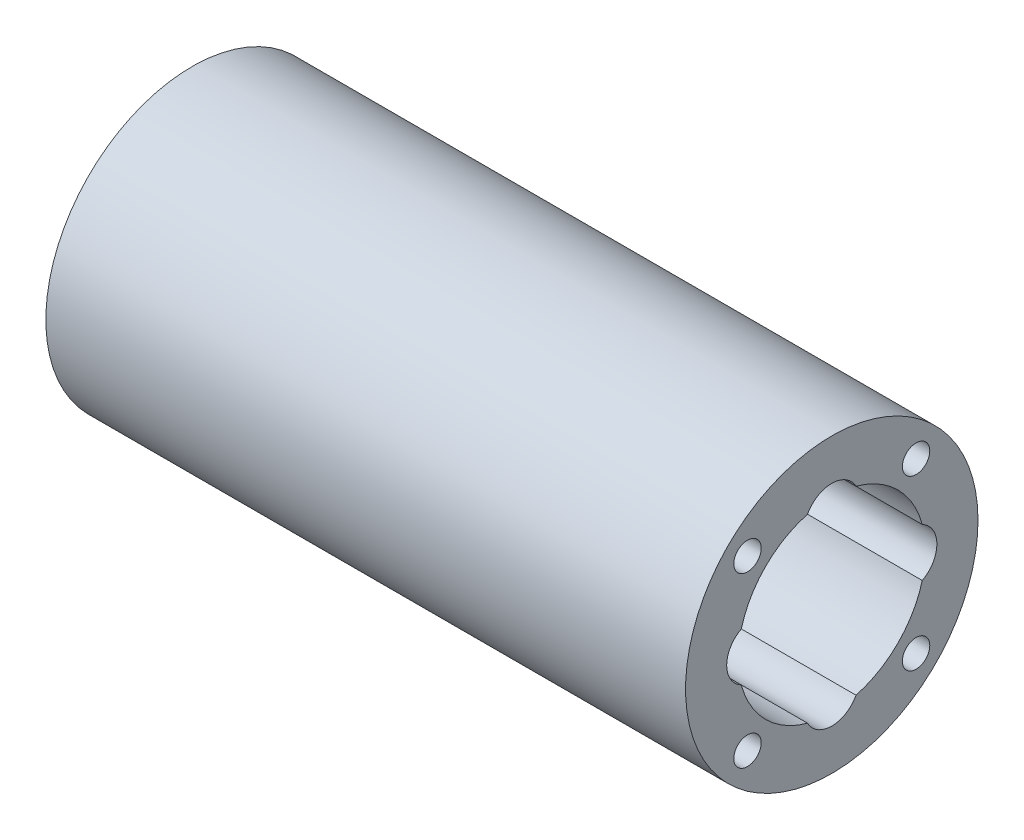
ISO-10303-21;
HEADER;
FILE_DESCRIPTION(('STEP AP214'),'2;1');
FILE_NAME('part.step','',(''),(''),'','','');
FILE_SCHEMA(('AUTOMOTIVE_DESIGN { 1 0 10303 214 1 1 1 1 }'));
ENDSEC;
DATA;
#1=APPLICATION_CONTEXT('core data for automotive mechanical design processes');
#2=APPLICATION_PROTOCOL_DEFINITION('international standard','automotive_design',2000,#1);
#3=PRODUCT_CONTEXT('',#1,'mechanical');
#4=PRODUCT('Part','Part','',(#3));
#5=PRODUCT_RELATED_PRODUCT_CATEGORY('part','',(#4));
#6=PRODUCT_DEFINITION_FORMATION('','',#4);
#7=PRODUCT_DEFINITION_CONTEXT('part definition',#1,'design');
#8=PRODUCT_DEFINITION('design','',#6,#7);
#9=PRODUCT_DEFINITION_SHAPE('','',#8);
#10=(LENGTH_UNIT() NAMED_UNIT(*) SI_UNIT(.MILLI.,.METRE.));
#11=(NAMED_UNIT(*) PLANE_ANGLE_UNIT() SI_UNIT($,.RADIAN.));
#12=(NAMED_UNIT(*) SI_UNIT($,.STERADIAN.) SOLID_ANGLE_UNIT());
#13=UNCERTAINTY_MEASURE_WITH_UNIT(LENGTH_MEASURE(1.E-05),#10,'distance_accuracy_value','');
#14=(GEOMETRIC_REPRESENTATION_CONTEXT(3) GLOBAL_UNCERTAINTY_ASSIGNED_CONTEXT((#13)) GLOBAL_UNIT_ASSIGNED_CONTEXT((#10,
#11,#12)) REPRESENTATION_CONTEXT('',''));
#15=CARTESIAN_POINT('',(0.,0.,0.));
#16=DIRECTION('',(0.,0.,1.));
#17=DIRECTION('',(1.,0.,0.));
#18=AXIS2_PLACEMENT_3D('',#15,#16,#17);
#19=CARTESIAN_POINT('',(3.,0.,0.));
#20=DIRECTION('',(1.,0.,0.));
#21=DIRECTION('',(0.,0.,-1.));
#22=AXIS2_PLACEMENT_3D('',#19,#20,#21);
#23=PLANE('',#22);
#24=CARTESIAN_POINT('',(3.,0.,8.5));
#25=DIRECTION('',(1.,0.,0.));
#26=DIRECTION('',(0.,0.,-1.));
#27=AXIS2_PLACEMENT_3D('',#24,#25,#26);
#28=CIRCLE('',#27,1.5);
#29=CARTESIAN_POINT('',(3.,0.,7.));
#30=VERTEX_POINT('',#29);
#31=EDGE_CURVE('E284',#30,#30,#28,.T.);
#32=ORIENTED_EDGE('',*,*,#31,.F.);
#33=EDGE_LOOP('',(#32));
#34=FACE_BOUND('',#33,.T.);
#35=CARTESIAN_POINT('',(3.,0.,-8.5));
#36=DIRECTION('',(1.,0.,0.));
#37=DIRECTION('',(0.,0.,-1.));
#38=AXIS2_PLACEMENT_3D('',#35,#36,#37);
#39=CIRCLE('',#38,1.5);
#40=CARTESIAN_POINT('',(3.,0.,-10.));
#41=VERTEX_POINT('',#40);
#42=EDGE_CURVE('E295',#41,#41,#39,.T.);
#43=ORIENTED_EDGE('',*,*,#42,.F.);
#44=EDGE_LOOP('',(#43));
#45=FACE_BOUND('',#44,.T.);
#46=CARTESIAN_POINT('',(3.,-8.5,0.));
#47=DIRECTION('',(1.,0.,0.));
#48=DIRECTION('',(0.,0.,-1.));
#49=AXIS2_PLACEMENT_3D('',#46,#47,#48);
#50=CIRCLE('',#49,1.5);
#51=CARTESIAN_POINT('',(3.,-8.5,-1.49999999999994));
#52=VERTEX_POINT('',#51);
#53=EDGE_CURVE('E12',#52,#52,#50,.T.);
#54=ORIENTED_EDGE('',*,*,#53,.F.);
#55=EDGE_LOOP('',(#54));
#56=FACE_BOUND('',#55,.T.);
#57=CARTESIAN_POINT('',(3.,8.5,0.));
#58=DIRECTION('',(1.,0.,0.));
#59=DIRECTION('',(0.,0.,-1.));
#60=AXIS2_PLACEMENT_3D('',#57,#58,#59);
#61=CIRCLE('',#60,1.5);
#62=CARTESIAN_POINT('',(3.,8.5,-1.5));
#63=VERTEX_POINT('',#62);
#64=EDGE_CURVE('E78',#63,#63,#61,.T.);
#65=ORIENTED_EDGE('',*,*,#64,.F.);
#66=EDGE_LOOP('',(#65));
#67=FACE_BOUND('',#66,.T.);
#68=CARTESIAN_POINT('',(3.,0.,0.));
#69=DIRECTION('',(1.,0.,0.));
#70=DIRECTION('',(0.,0.,-1.));
#71=AXIS2_PLACEMENT_3D('',#68,#69,#70);
#72=CIRCLE('',#71,5.25);
#73=CARTESIAN_POINT('',(3.,0.,-5.25));
#74=VERTEX_POINT('',#73);
#75=EDGE_CURVE('E373',#74,#74,#72,.T.);
#76=ORIENTED_EDGE('',*,*,#75,.F.);
#77=EDGE_LOOP('',(#76));
#78=FACE_BOUND('',#77,.T.);
#79=CARTESIAN_POINT('',(3.,-8.5,0.));
#80=DIRECTION('',(1.,0.,0.));
#81=DIRECTION('',(0.,0.,-1.));
#82=AXIS2_PLACEMENT_3D('',#79,#80,#81);
#83=CIRCLE('',#82,3.);
#84=CARTESIAN_POINT('',(3.,-9.90073529411763,2.65291172785932));
#85=VERTEX_POINT('',#84);
#86=CARTESIAN_POINT('',(3.,-9.90073529411767,-2.65291172785918));
#87=VERTEX_POINT('',#86);
#88=EDGE_CURVE('E195',#85,#87,#83,.T.);
#89=ORIENTED_EDGE('',*,*,#88,.T.);
#90=CARTESIAN_POINT('',(3.,0.,0.));
#91=DIRECTION('',(1.,0.,0.));
#92=DIRECTION('',(0.,0.,-1.));
#93=AXIS2_PLACEMENT_3D('',#90,#91,#92);
#94=CIRCLE('',#93,10.25);
#95=CARTESIAN_POINT('',(3.,-2.65291172785928,-9.90073529411764));
#96=VERTEX_POINT('',#95);
#97=EDGE_CURVE('E232',#87,#96,#94,.T.);
#98=ORIENTED_EDGE('',*,*,#97,.T.);
#99=CARTESIAN_POINT('',(3.,0.,-8.5));
#100=DIRECTION('',(1.,0.,0.));
#101=DIRECTION('',(0.,0.,-1.));
#102=AXIS2_PLACEMENT_3D('',#99,#100,#101);
#103=CIRCLE('',#102,3.);
#104=CARTESIAN_POINT('',(3.,2.65291172785921,-9.90073529411766));
#105=VERTEX_POINT('',#104);
#106=EDGE_CURVE('E201',#96,#105,#103,.T.);
#107=ORIENTED_EDGE('',*,*,#106,.T.);
#108=CARTESIAN_POINT('',(3.,0.,0.));
#109=DIRECTION('',(1.,0.,0.));
#110=DIRECTION('',(0.,0.,-1.));
#111=AXIS2_PLACEMENT_3D('',#108,#109,#110);
#112=CIRCLE('',#111,10.25);
#113=CARTESIAN_POINT('',(3.,9.90073529411765,-2.65291172785925));
#114=VERTEX_POINT('',#113);
#115=EDGE_CURVE('E238',#105,#114,#112,.T.);
#116=ORIENTED_EDGE('',*,*,#115,.T.);
#117=CARTESIAN_POINT('',(3.,8.5,0.));
#118=DIRECTION('',(1.,0.,0.));
#119=DIRECTION('',(0.,0.,-1.));
#120=AXIS2_PLACEMENT_3D('',#117,#118,#119);
#121=CIRCLE('',#120,3.);
#122=CARTESIAN_POINT('',(3.,9.90073529411765,2.65291172785925));
#123=VERTEX_POINT('',#122);
#124=EDGE_CURVE('E242',#114,#123,#121,.T.);
#125=ORIENTED_EDGE('',*,*,#124,.T.);
#126=CARTESIAN_POINT('',(3.,0.,0.));
#127=DIRECTION('',(1.,0.,0.));
#128=DIRECTION('',(0.,0.,-1.));
#129=AXIS2_PLACEMENT_3D('',#126,#127,#128);
#130=CIRCLE('',#129,10.25);
#131=CARTESIAN_POINT('',(3.,2.65291172785935,9.90073529411762));
#132=VERTEX_POINT('',#131);
#133=EDGE_CURVE('E246',#123,#132,#130,.T.);
#134=ORIENTED_EDGE('',*,*,#133,.T.);
#135=CARTESIAN_POINT('',(3.,0.,8.5));
#136=DIRECTION('',(1.,0.,0.));
#137=DIRECTION('',(0.,0.,-1.));
#138=AXIS2_PLACEMENT_3D('',#135,#136,#137);
#139=CIRCLE('',#138,3.);
#140=CARTESIAN_POINT('',(3.,-2.65291172785914,9.90073529411768));
#141=VERTEX_POINT('',#140);
#142=EDGE_CURVE('E250',#132,#141,#139,.T.);
#143=ORIENTED_EDGE('',*,*,#142,.T.);
#144=CARTESIAN_POINT('',(3.,0.,0.));
#145=DIRECTION('',(1.,0.,0.));
#146=DIRECTION('',(0.,0.,-1.));
#147=AXIS2_PLACEMENT_3D('',#144,#145,#146);
#148=CIRCLE('',#147,10.25);
#149=EDGE_CURVE('E254',#141,#85,#148,.T.);
#150=ORIENTED_EDGE('',*,*,#149,.T.);
#151=EDGE_LOOP('',(#89,#98,#107,#116,#125,#134,#143,#150));
#152=FACE_BOUND('',#151,.T.);
#153=ADVANCED_FACE('F68',(#34,#45,#56,#67,#78,#152),#23,.T.);
#154=CARTESIAN_POINT('',(3.,0.,8.5));
#155=DIRECTION('',(-1.,0.,0.));
#156=DIRECTION('',(0.,0.,1.));
#157=AXIS2_PLACEMENT_3D('',#154,#155,#156);
#158=CYLINDRICAL_SURFACE('',#157,3.);
#159=DIRECTION('',(1.,0.,0.));
#160=VECTOR('',#159,1.);
#161=CARTESIAN_POINT('',(-10.,2.65291172785935,9.90073529411762));
#162=LINE('',#161,#160);
#163=CARTESIAN_POINT('',(-10.,2.65291172785935,9.90073529411762));
#164=VERTEX_POINT('',#163);
#165=CARTESIAN_POINT('',(0.,2.65291172785935,9.90073529411762));
#166=VERTEX_POINT('',#165);
#167=EDGE_CURVE('E329',#164,#166,#162,.T.);
#168=ORIENTED_EDGE('',*,*,#167,.T.);
#169=CARTESIAN_POINT('',(0.,0.,8.5));
#170=DIRECTION('',(1.,0.,0.));
#171=DIRECTION('',(0.,0.,-1.));
#172=AXIS2_PLACEMENT_3D('',#169,#170,#171);
#173=CIRCLE('',#172,3.);
#174=CARTESIAN_POINT('',(0.,-2.65291172785914,9.90073529411768));
#175=VERTEX_POINT('',#174);
#176=EDGE_CURVE('E289',#166,#175,#173,.T.);
#177=ORIENTED_EDGE('',*,*,#176,.T.);
#178=DIRECTION('',(1.,0.,0.));
#179=VECTOR('',#178,1.);
#180=CARTESIAN_POINT('',(-10.,-2.65291172785914,9.90073529411768));
#181=LINE('',#180,#179);
#182=CARTESIAN_POINT('',(-10.,-2.65291172785914,9.90073529411768));
#183=VERTEX_POINT('',#182);
#184=EDGE_CURVE('E341',#183,#175,#181,.T.);
#185=ORIENTED_EDGE('',*,*,#184,.F.);
#186=CARTESIAN_POINT('',(-10.,0.,8.5));
#187=DIRECTION('',(1.,0.,0.));
#188=DIRECTION('',(0.,0.,-1.));
#189=AXIS2_PLACEMENT_3D('',#186,#187,#188);
#190=CIRCLE('',#189,3.);
#191=EDGE_CURVE('E305',#164,#183,#190,.T.);
#192=ORIENTED_EDGE('',*,*,#191,.F.);
#193=EDGE_LOOP('',(#168,#177,#185,#192));
#194=FACE_BOUND('',#193,.T.);
#195=ADVANCED_FACE('F70',(#194),#158,.F.);
#196=CARTESIAN_POINT('',(3.,0.,-8.5));
#197=DIRECTION('',(-1.,0.,0.));
#198=DIRECTION('',(0.,0.,1.));
#199=AXIS2_PLACEMENT_3D('',#196,#197,#198);
#200=CYLINDRICAL_SURFACE('',#199,3.);
#201=DIRECTION('',(1.,0.,0.));
#202=VECTOR('',#201,1.);
#203=CARTESIAN_POINT('',(-10.,-2.65291172785928,-9.90073529411764));
#204=LINE('',#203,#202);
#205=CARTESIAN_POINT('',(-10.,-2.65291172785928,-9.90073529411764));
#206=VERTEX_POINT('',#205);
#207=CARTESIAN_POINT('',(0.,-2.65291172785928,-9.90073529411764));
#208=VERTEX_POINT('',#207);
#209=EDGE_CURVE('E354',#206,#208,#204,.T.);
#210=ORIENTED_EDGE('',*,*,#209,.T.);
#211=CARTESIAN_POINT('',(0.,0.,-8.5));
#212=DIRECTION('',(1.,0.,0.));
#213=DIRECTION('',(0.,0.,-1.));
#214=AXIS2_PLACEMENT_3D('',#211,#212,#213);
#215=CIRCLE('',#214,3.);
#216=CARTESIAN_POINT('',(0.,2.65291172785921,-9.90073529411766));
#217=VERTEX_POINT('',#216);
#218=EDGE_CURVE('E288',#208,#217,#215,.T.);
#219=ORIENTED_EDGE('',*,*,#218,.T.);
#220=DIRECTION('',(1.,0.,0.));
#221=VECTOR('',#220,1.);
#222=CARTESIAN_POINT('',(-10.,2.65291172785921,-9.90073529411766));
#223=LINE('',#222,#221);
#224=CARTESIAN_POINT('',(-10.,2.65291172785921,-9.90073529411766));
#225=VERTEX_POINT('',#224);
#226=EDGE_CURVE('E358',#225,#217,#223,.T.);
#227=ORIENTED_EDGE('',*,*,#226,.F.);
#228=CARTESIAN_POINT('',(-10.,0.,-8.5));
#229=DIRECTION('',(1.,0.,0.));
#230=DIRECTION('',(0.,0.,-1.));
#231=AXIS2_PLACEMENT_3D('',#228,#229,#230);
#232=CIRCLE('',#231,3.);
#233=EDGE_CURVE('E318',#206,#225,#232,.T.);
#234=ORIENTED_EDGE('',*,*,#233,.F.);
#235=EDGE_LOOP('',(#210,#219,#227,#234));
#236=FACE_BOUND('',#235,.T.);
#237=ADVANCED_FACE('F419',(#236),#200,.F.);
#238=CARTESIAN_POINT('',(0.,0.,0.));
#239=DIRECTION('',(1.,0.,0.));
#240=DIRECTION('',(0.,0.,-1.));
#241=AXIS2_PLACEMENT_3D('',#238,#239,#240);
#242=PLANE('',#241);
#243=CARTESIAN_POINT('',(0.,-8.5,0.));
#244=DIRECTION('',(1.,0.,0.));
#245=DIRECTION('',(0.,0.,-1.));
#246=AXIS2_PLACEMENT_3D('',#243,#244,#245);
#247=CIRCLE('',#246,1.5);
#248=CARTESIAN_POINT('',(0.,-8.5,-1.49999999999994));
#249=VERTEX_POINT('',#248);
#250=EDGE_CURVE('E72',#249,#249,#247,.T.);
#251=ORIENTED_EDGE('',*,*,#250,.T.);
#252=EDGE_LOOP('',(#251));
#253=FACE_BOUND('',#252,.T.);
#254=CARTESIAN_POINT('',(0.,8.5,0.));
#255=DIRECTION('',(1.,0.,0.));
#256=DIRECTION('',(0.,0.,-1.));
#257=AXIS2_PLACEMENT_3D('',#254,#255,#256);
#258=CIRCLE('',#257,1.5);
#259=CARTESIAN_POINT('',(0.,8.5,-1.5));
#260=VERTEX_POINT('',#259);
#261=EDGE_CURVE('E382',#260,#260,#258,.T.);
#262=ORIENTED_EDGE('',*,*,#261,.T.);
#263=EDGE_LOOP('',(#262));
#264=FACE_BOUND('',#263,.T.);
#265=CARTESIAN_POINT('',(0.,0.,0.));
#266=DIRECTION('',(1.,0.,0.));
#267=DIRECTION('',(0.,0.,-1.));
#268=AXIS2_PLACEMENT_3D('',#265,#266,#267);
#269=CIRCLE('',#268,5.25);
#270=CARTESIAN_POINT('',(0.,0.,-5.25));
#271=VERTEX_POINT('',#270);
#272=EDGE_CURVE('E345',#271,#271,#269,.T.);
#273=ORIENTED_EDGE('',*,*,#272,.T.);
#274=EDGE_LOOP('',(#273));
#275=FACE_BOUND('',#274,.T.);
#276=CARTESIAN_POINT('',(0.,0.,0.));
#277=DIRECTION('',(1.,0.,0.));
#278=DIRECTION('',(0.,0.,-1.));
#279=AXIS2_PLACEMENT_3D('',#276,#277,#278);
#280=CIRCLE('',#279,10.25);
#281=CARTESIAN_POINT('',(0.,9.90073529411765,2.65291172785925));
#282=VERTEX_POINT('',#281);
#283=EDGE_CURVE('E94',#282,#166,#280,.T.);
#284=ORIENTED_EDGE('',*,*,#283,.F.);
#285=CARTESIAN_POINT('',(0.,8.5,0.));
#286=DIRECTION('',(1.,0.,0.));
#287=DIRECTION('',(0.,0.,-1.));
#288=AXIS2_PLACEMENT_3D('',#285,#286,#287);
#289=CIRCLE('',#288,3.);
#290=CARTESIAN_POINT('',(0.,9.90073529411765,-2.65291172785925));
#291=VERTEX_POINT('',#290);
#292=EDGE_CURVE('E332',#291,#282,#289,.T.);
#293=ORIENTED_EDGE('',*,*,#292,.F.);
#294=EDGE_CURVE('E333',#217,#291,#280,.T.);
#295=ORIENTED_EDGE('',*,*,#294,.F.);
#296=ORIENTED_EDGE('',*,*,#218,.F.);
#297=CARTESIAN_POINT('',(0.,-9.90073529411767,-2.65291172785918));
#298=VERTEX_POINT('',#297);
#299=EDGE_CURVE('E340',#298,#208,#280,.T.);
#300=ORIENTED_EDGE('',*,*,#299,.F.);
#301=CARTESIAN_POINT('',(0.,-8.5,0.));
#302=DIRECTION('',(1.,0.,0.));
#303=DIRECTION('',(0.,0.,-1.));
#304=AXIS2_PLACEMENT_3D('',#301,#302,#303);
#305=CIRCLE('',#304,3.);
#306=CARTESIAN_POINT('',(0.,-9.90073529411763,2.65291172785932));
#307=VERTEX_POINT('',#306);
#308=EDGE_CURVE('E336',#307,#298,#305,.T.);
#309=ORIENTED_EDGE('',*,*,#308,.F.);
#310=EDGE_CURVE('E310',#175,#307,#280,.T.);
#311=ORIENTED_EDGE('',*,*,#310,.F.);
#312=ORIENTED_EDGE('',*,*,#176,.F.);
#313=EDGE_LOOP('',(#284,#293,#295,#296,#300,#309,#311,#312));
#314=FACE_BOUND('',#313,.T.);
#315=CARTESIAN_POINT('',(0.,0.,-8.5));
#316=DIRECTION('',(1.,0.,0.));
#317=DIRECTION('',(0.,0.,-1.));
#318=AXIS2_PLACEMENT_3D('',#315,#316,#317);
#319=CIRCLE('',#318,1.5);
#320=CARTESIAN_POINT('',(0.,0.,-10.));
#321=VERTEX_POINT('',#320);
#322=EDGE_CURVE('E299',#321,#321,#319,.T.);
#323=ORIENTED_EDGE('',*,*,#322,.T.);
#324=EDGE_LOOP('',(#323));
#325=FACE_BOUND('',#324,.T.);
#326=CARTESIAN_POINT('',(0.,0.,8.5));
#327=DIRECTION('',(1.,0.,0.));
#328=DIRECTION('',(0.,0.,-1.));
#329=AXIS2_PLACEMENT_3D('',#326,#327,#328);
#330=CIRCLE('',#329,1.5);
#331=CARTESIAN_POINT('',(0.,0.,7.));
#332=VERTEX_POINT('',#331);
#333=EDGE_CURVE('E283',#332,#332,#330,.T.);
#334=ORIENTED_EDGE('',*,*,#333,.T.);
#335=EDGE_LOOP('',(#334));
#336=FACE_BOUND('',#335,.T.);
#337=ADVANCED_FACE('F391',(#253,#264,#275,#314,#325,#336),#242,.F.);
#338=CARTESIAN_POINT('',(3.,8.5,0.));
#339=DIRECTION('',(-1.,0.,0.));
#340=DIRECTION('',(0.,0.,1.));
#341=AXIS2_PLACEMENT_3D('',#338,#339,#340);
#342=CYLINDRICAL_SURFACE('',#341,1.5);
#343=ORIENTED_EDGE('',*,*,#64,.T.);
#344=EDGE_LOOP('',(#343));
#345=FACE_BOUND('',#344,.T.);
#346=ORIENTED_EDGE('',*,*,#261,.F.);
#347=EDGE_LOOP('',(#346));
#348=FACE_BOUND('',#347,.T.);
#349=ADVANCED_FACE('F427',(#345,#348),#342,.F.);
#350=CARTESIAN_POINT('',(3.,0.,0.));
#351=DIRECTION('',(-1.,0.,0.));
#352=DIRECTION('',(0.,0.,1.));
#353=AXIS2_PLACEMENT_3D('',#350,#351,#352);
#354=CYLINDRICAL_SURFACE('',#353,5.25);
#355=ORIENTED_EDGE('',*,*,#75,.T.);
#356=EDGE_LOOP('',(#355));
#357=FACE_BOUND('',#356,.T.);
#358=ORIENTED_EDGE('',*,*,#272,.F.);
#359=EDGE_LOOP('',(#358));
#360=FACE_BOUND('',#359,.T.);
#361=ADVANCED_FACE('F408',(#357,#360),#354,.F.);
#362=CARTESIAN_POINT('',(3.,0.,0.));
#363=DIRECTION('',(-1.,0.,0.));
#364=DIRECTION('',(0.,0.,1.));
#365=AXIS2_PLACEMENT_3D('',#362,#363,#364);
#366=CYLINDRICAL_SURFACE('',#365,16.);
#367=CARTESIAN_POINT('',(-10.,0.,0.));
#368=DIRECTION('',(1.,0.,0.));
#369=DIRECTION('',(0.,0.,-1.));
#370=AXIS2_PLACEMENT_3D('',#367,#368,#369);
#371=CIRCLE('',#370,16.);
#372=CARTESIAN_POINT('',(-10.,0.,-16.));
#373=VERTEX_POINT('',#372);
#374=EDGE_CURVE('E325',#373,#373,#371,.T.);
#375=ORIENTED_EDGE('',*,*,#374,.T.);
#376=EDGE_LOOP('',(#375));
#377=FACE_BOUND('',#376,.T.);
#378=CARTESIAN_POINT('',(60.,0.,0.));
#379=DIRECTION('',(1.,0.,0.));
#380=DIRECTION('',(0.,0.,-1.));
#381=AXIS2_PLACEMENT_3D('',#378,#379,#380);
#382=CIRCLE('',#381,16.);
#383=CARTESIAN_POINT('',(60.,0.,-16.));
#384=VERTEX_POINT('',#383);
#385=EDGE_CURVE('E203',#384,#384,#382,.T.);
#386=ORIENTED_EDGE('',*,*,#385,.F.);
#387=EDGE_LOOP('',(#386));
#388=FACE_BOUND('',#387,.T.);
#389=ADVANCED_FACE('F396',(#377,#388),#366,.T.);
#390=CARTESIAN_POINT('',(3.,-8.5,0.));
#391=DIRECTION('',(-1.,0.,0.));
#392=DIRECTION('',(0.,0.,1.));
#393=AXIS2_PLACEMENT_3D('',#390,#391,#392);
#394=CYLINDRICAL_SURFACE('',#393,1.5);
#395=ORIENTED_EDGE('',*,*,#53,.T.);
#396=EDGE_LOOP('',(#395));
#397=FACE_BOUND('',#396,.T.);
#398=ORIENTED_EDGE('',*,*,#250,.F.);
#399=EDGE_LOOP('',(#398));
#400=FACE_BOUND('',#399,.T.);
#401=ADVANCED_FACE('F393',(#397,#400),#394,.F.);
#402=CARTESIAN_POINT('',(-10.,0.,0.));
#403=DIRECTION('',(1.,0.,0.));
#404=DIRECTION('',(0.,0.,-1.));
#405=AXIS2_PLACEMENT_3D('',#402,#403,#404);
#406=CYLINDRICAL_SURFACE('',#405,10.25);
#407=ORIENTED_EDGE('',*,*,#310,.T.);
#408=DIRECTION('',(1.,0.,0.));
#409=VECTOR('',#408,1.);
#410=CARTESIAN_POINT('',(-10.,-9.90073529411763,2.65291172785932));
#411=LINE('',#410,#409);
#412=CARTESIAN_POINT('',(-10.,-9.90073529411763,2.65291172785932));
#413=VERTEX_POINT('',#412);
#414=EDGE_CURVE('E346',#413,#307,#411,.T.);
#415=ORIENTED_EDGE('',*,*,#414,.F.);
#416=CARTESIAN_POINT('',(-10.,0.,0.));
#417=DIRECTION('',(1.,0.,0.));
#418=DIRECTION('',(0.,0.,-1.));
#419=AXIS2_PLACEMENT_3D('',#416,#417,#418);
#420=CIRCLE('',#419,10.25);
#421=EDGE_CURVE('E314',#183,#413,#420,.T.);
#422=ORIENTED_EDGE('',*,*,#421,.F.);
#423=ORIENTED_EDGE('',*,*,#184,.T.);
#424=EDGE_LOOP('',(#407,#415,#422,#423));
#425=FACE_BOUND('',#424,.T.);
#426=ADVANCED_FACE('F395',(#425),#406,.F.);
#427=CARTESIAN_POINT('',(-10.,-8.5,0.));
#428=DIRECTION('',(1.,0.,0.));
#429=DIRECTION('',(0.,0.,-1.));
#430=AXIS2_PLACEMENT_3D('',#427,#428,#429);
#431=CYLINDRICAL_SURFACE('',#430,3.);
#432=ORIENTED_EDGE('',*,*,#308,.T.);
#433=DIRECTION('',(1.,0.,0.));
#434=VECTOR('',#433,1.);
#435=CARTESIAN_POINT('',(-10.,-9.90073529411767,-2.65291172785918));
#436=LINE('',#435,#434);
#437=CARTESIAN_POINT('',(-10.,-9.90073529411767,-2.65291172785918));
#438=VERTEX_POINT('',#437);
#439=EDGE_CURVE('E350',#438,#298,#436,.T.);
#440=ORIENTED_EDGE('',*,*,#439,.F.);
#441=CARTESIAN_POINT('',(-10.,-8.5,0.));
#442=DIRECTION('',(1.,0.,0.));
#443=DIRECTION('',(0.,0.,-1.));
#444=AXIS2_PLACEMENT_3D('',#441,#442,#443);
#445=CIRCLE('',#444,3.);
#446=EDGE_CURVE('E322',#413,#438,#445,.T.);
#447=ORIENTED_EDGE('',*,*,#446,.F.);
#448=ORIENTED_EDGE('',*,*,#414,.T.);
#449=EDGE_LOOP('',(#432,#440,#447,#448));
#450=FACE_BOUND('',#449,.T.);
#451=ADVANCED_FACE('F403',(#450),#431,.F.);
#452=ORIENTED_EDGE('',*,*,#299,.T.);
#453=ORIENTED_EDGE('',*,*,#209,.F.);
#454=EDGE_CURVE('E321',#438,#206,#420,.T.);
#455=ORIENTED_EDGE('',*,*,#454,.F.);
#456=ORIENTED_EDGE('',*,*,#439,.T.);
#457=EDGE_LOOP('',(#452,#453,#455,#456));
#458=FACE_BOUND('',#457,.T.);
#459=ADVANCED_FACE('F407',(#458),#406,.F.);
#460=ORIENTED_EDGE('',*,*,#294,.T.);
#461=DIRECTION('',(1.,0.,0.));
#462=VECTOR('',#461,1.);
#463=CARTESIAN_POINT('',(-10.,9.90073529411765,-2.65291172785925));
#464=LINE('',#463,#462);
#465=CARTESIAN_POINT('',(-10.,9.90073529411765,-2.65291172785925));
#466=VERTEX_POINT('',#465);
#467=EDGE_CURVE('E362',#466,#291,#464,.T.);
#468=ORIENTED_EDGE('',*,*,#467,.F.);
#469=EDGE_CURVE('E315',#225,#466,#420,.T.);
#470=ORIENTED_EDGE('',*,*,#469,.F.);
#471=ORIENTED_EDGE('',*,*,#226,.T.);
#472=EDGE_LOOP('',(#460,#468,#470,#471));
#473=FACE_BOUND('',#472,.T.);
#474=ADVANCED_FACE('F473',(#473),#406,.F.);
#475=CARTESIAN_POINT('',(-10.,8.5,0.));
#476=DIRECTION('',(1.,0.,0.));
#477=DIRECTION('',(0.,0.,-1.));
#478=AXIS2_PLACEMENT_3D('',#475,#476,#477);
#479=CYLINDRICAL_SURFACE('',#478,3.);
#480=ORIENTED_EDGE('',*,*,#292,.T.);
#481=DIRECTION('',(1.,0.,0.));
#482=VECTOR('',#481,1.);
#483=CARTESIAN_POINT('',(-10.,9.90073529411765,2.65291172785925));
#484=LINE('',#483,#482);
#485=CARTESIAN_POINT('',(-10.,9.90073529411765,2.65291172785925));
#486=VERTEX_POINT('',#485);
#487=EDGE_CURVE('E366',#486,#282,#484,.T.);
#488=ORIENTED_EDGE('',*,*,#487,.F.);
#489=CARTESIAN_POINT('',(-10.,8.5,0.));
#490=DIRECTION('',(1.,0.,0.));
#491=DIRECTION('',(0.,0.,-1.));
#492=AXIS2_PLACEMENT_3D('',#489,#490,#491);
#493=CIRCLE('',#492,3.);
#494=EDGE_CURVE('E313',#466,#486,#493,.T.);
#495=ORIENTED_EDGE('',*,*,#494,.F.);
#496=ORIENTED_EDGE('',*,*,#467,.T.);
#497=EDGE_LOOP('',(#480,#488,#495,#496));
#498=FACE_BOUND('',#497,.T.);
#499=ADVANCED_FACE('F424',(#498),#479,.F.);
#500=ORIENTED_EDGE('',*,*,#283,.T.);
#501=ORIENTED_EDGE('',*,*,#167,.F.);
#502=EDGE_CURVE('E309',#486,#164,#420,.T.);
#503=ORIENTED_EDGE('',*,*,#502,.F.);
#504=ORIENTED_EDGE('',*,*,#487,.T.);
#505=EDGE_LOOP('',(#500,#501,#503,#504));
#506=FACE_BOUND('',#505,.T.);
#507=ADVANCED_FACE('F406',(#506),#406,.F.);
#508=CARTESIAN_POINT('',(-10.,0.,0.));
#509=DIRECTION('',(1.,0.,0.));
#510=DIRECTION('',(0.,0.,-1.));
#511=AXIS2_PLACEMENT_3D('',#508,#509,#510);
#512=PLANE('',#511);
#513=ORIENTED_EDGE('',*,*,#191,.T.);
#514=ORIENTED_EDGE('',*,*,#421,.T.);
#515=ORIENTED_EDGE('',*,*,#446,.T.);
#516=ORIENTED_EDGE('',*,*,#454,.T.);
#517=ORIENTED_EDGE('',*,*,#233,.T.);
#518=ORIENTED_EDGE('',*,*,#469,.T.);
#519=ORIENTED_EDGE('',*,*,#494,.T.);
#520=ORIENTED_EDGE('',*,*,#502,.T.);
#521=EDGE_LOOP('',(#513,#514,#515,#516,#517,#518,#519,#520));
#522=FACE_BOUND('',#521,.T.);
#523=ORIENTED_EDGE('',*,*,#374,.F.);
#524=EDGE_LOOP('',(#523));
#525=FACE_BOUND('',#524,.T.);
#526=ADVANCED_FACE('F461',(#522,#525),#512,.F.);
#527=CARTESIAN_POINT('',(3.,0.,-8.5));
#528=DIRECTION('',(-1.,0.,0.));
#529=DIRECTION('',(0.,0.,1.));
#530=AXIS2_PLACEMENT_3D('',#527,#528,#529);
#531=CYLINDRICAL_SURFACE('',#530,1.5);
#532=ORIENTED_EDGE('',*,*,#42,.T.);
#533=EDGE_LOOP('',(#532));
#534=FACE_BOUND('',#533,.T.);
#535=ORIENTED_EDGE('',*,*,#322,.F.);
#536=EDGE_LOOP('',(#535));
#537=FACE_BOUND('',#536,.T.);
#538=ADVANCED_FACE('F452',(#534,#537),#531,.F.);
#539=CARTESIAN_POINT('',(3.,0.,8.5));
#540=DIRECTION('',(-1.,0.,0.));
#541=DIRECTION('',(0.,0.,1.));
#542=AXIS2_PLACEMENT_3D('',#539,#540,#541);
#543=CYLINDRICAL_SURFACE('',#542,1.5);
#544=ORIENTED_EDGE('',*,*,#31,.T.);
#545=EDGE_LOOP('',(#544));
#546=FACE_BOUND('',#545,.T.);
#547=ORIENTED_EDGE('',*,*,#333,.F.);
#548=EDGE_LOOP('',(#547));
#549=FACE_BOUND('',#548,.T.);
#550=ADVANCED_FACE('F450',(#546,#549),#543,.F.);
#551=CARTESIAN_POINT('',(60.,0.,0.));
#552=DIRECTION('',(1.,0.,0.));
#553=DIRECTION('',(0.,0.,-1.));
#554=AXIS2_PLACEMENT_3D('',#551,#552,#553);
#555=PLANE('',#554);
#556=CARTESIAN_POINT('',(60.,-9.22279874055178,9.22279874055283));
#557=DIRECTION('',(1.,0.,0.));
#558=DIRECTION('',(0.,0.,-1.));
#559=AXIS2_PLACEMENT_3D('',#556,#557,#558);
#560=CIRCLE('',#559,1.50000000000067);
#561=CARTESIAN_POINT('',(60.,-9.22279874055178,7.72279874055215));
#562=VERTEX_POINT('',#561);
#563=EDGE_CURVE('E783',#562,#562,#560,.T.);
#564=ORIENTED_EDGE('',*,*,#563,.F.);
#565=EDGE_LOOP('',(#564));
#566=FACE_BOUND('',#565,.T.);
#567=CARTESIAN_POINT('',(60.,-9.2227987405523,-9.22279874055178));
#568=DIRECTION('',(1.,0.,0.));
#569=DIRECTION('',(0.,0.,-1.));
#570=AXIS2_PLACEMENT_3D('',#567,#568,#569);
#571=CIRCLE('',#570,1.50000000000021);
#572=CARTESIAN_POINT('',(60.,-9.2227987405523,-10.722798740552));
#573=VERTEX_POINT('',#572);
#574=EDGE_CURVE('E782',#573,#573,#571,.T.);
#575=ORIENTED_EDGE('',*,*,#574,.F.);
#576=EDGE_LOOP('',(#575));
#577=FACE_BOUND('',#576,.T.);
#578=CARTESIAN_POINT('',(60.,9.22279874055226,-9.22279874055235));
#579=DIRECTION('',(1.,0.,0.));
#580=DIRECTION('',(0.,0.,-1.));
#581=AXIS2_PLACEMENT_3D('',#578,#579,#580);
#582=CIRCLE('',#581,1.5);
#583=CARTESIAN_POINT('',(60.,9.22279874055226,-10.7227987405524));
#584=VERTEX_POINT('',#583);
#585=EDGE_CURVE('E804',#584,#584,#582,.T.);
#586=ORIENTED_EDGE('',*,*,#585,.F.);
#587=EDGE_LOOP('',(#586));
#588=FACE_BOUND('',#587,.T.);
#589=CARTESIAN_POINT('',(60.,9.22279874055283,9.2227987405523));
#590=DIRECTION('',(1.,0.,0.));
#591=DIRECTION('',(0.,0.,-1.));
#592=AXIS2_PLACEMENT_3D('',#589,#590,#591);
#593=CIRCLE('',#592,1.50000000000048);
#594=CARTESIAN_POINT('',(60.,9.22279874055283,7.72279874055182));
#595=VERTEX_POINT('',#594);
#596=EDGE_CURVE('E796',#595,#595,#593,.T.);
#597=ORIENTED_EDGE('',*,*,#596,.F.);
#598=EDGE_LOOP('',(#597));
#599=FACE_BOUND('',#598,.T.);
#600=ORIENTED_EDGE('',*,*,#385,.T.);
#601=EDGE_LOOP('',(#600));
#602=FACE_BOUND('',#601,.T.);
#603=CARTESIAN_POINT('',(60.,0.,-8.5));
#604=DIRECTION('',(1.,0.,0.));
#605=DIRECTION('',(0.,0.,-1.));
#606=AXIS2_PLACEMENT_3D('',#603,#604,#605);
#607=CIRCLE('',#606,3.);
#608=CARTESIAN_POINT('',(60.,-2.65291172785928,-9.90073529411764));
#609=VERTEX_POINT('',#608);
#610=CARTESIAN_POINT('',(60.,2.65291172785921,-9.90073529411766));
#611=VERTEX_POINT('',#610);
#612=EDGE_CURVE('E194',#609,#611,#607,.T.);
#613=ORIENTED_EDGE('',*,*,#612,.F.);
#614=CARTESIAN_POINT('',(60.,0.,0.));
#615=DIRECTION('',(1.,0.,0.));
#616=DIRECTION('',(0.,0.,-1.));
#617=AXIS2_PLACEMENT_3D('',#614,#615,#616);
#618=CIRCLE('',#617,10.25);
#619=CARTESIAN_POINT('',(60.,-9.90073529411767,-2.65291172785918));
#620=VERTEX_POINT('',#619);
#621=EDGE_CURVE('E185',#620,#609,#618,.T.);
#622=ORIENTED_EDGE('',*,*,#621,.F.);
#623=CARTESIAN_POINT('',(60.,-8.5,0.));
#624=DIRECTION('',(1.,0.,0.));
#625=DIRECTION('',(0.,0.,-1.));
#626=AXIS2_PLACEMENT_3D('',#623,#624,#625);
#627=CIRCLE('',#626,3.);
#628=CARTESIAN_POINT('',(60.,-9.90073529411763,2.65291172785932));
#629=VERTEX_POINT('',#628);
#630=EDGE_CURVE('E229',#629,#620,#627,.T.);
#631=ORIENTED_EDGE('',*,*,#630,.F.);
#632=CARTESIAN_POINT('',(60.,0.,0.));
#633=DIRECTION('',(1.,0.,0.));
#634=DIRECTION('',(0.,0.,-1.));
#635=AXIS2_PLACEMENT_3D('',#632,#633,#634);
#636=CIRCLE('',#635,10.25);
#637=CARTESIAN_POINT('',(60.,-2.65291172785914,9.90073529411768));
#638=VERTEX_POINT('',#637);
#639=EDGE_CURVE('E225',#638,#629,#636,.T.);
#640=ORIENTED_EDGE('',*,*,#639,.F.);
#641=CARTESIAN_POINT('',(60.,0.,8.5));
#642=DIRECTION('',(1.,0.,0.));
#643=DIRECTION('',(0.,0.,-1.));
#644=AXIS2_PLACEMENT_3D('',#641,#642,#643);
#645=CIRCLE('',#644,3.);
#646=CARTESIAN_POINT('',(60.,2.65291172785935,9.90073529411762));
#647=VERTEX_POINT('',#646);
#648=EDGE_CURVE('E222',#647,#638,#645,.T.);
#649=ORIENTED_EDGE('',*,*,#648,.F.);
#650=CARTESIAN_POINT('',(60.,0.,0.));
#651=DIRECTION('',(1.,0.,0.));
#652=DIRECTION('',(0.,0.,-1.));
#653=AXIS2_PLACEMENT_3D('',#650,#651,#652);
#654=CIRCLE('',#653,10.25);
#655=CARTESIAN_POINT('',(60.,9.90073529411765,2.65291172785925));
#656=VERTEX_POINT('',#655);
#657=EDGE_CURVE('E219',#656,#647,#654,.T.);
#658=ORIENTED_EDGE('',*,*,#657,.F.);
#659=CARTESIAN_POINT('',(60.,8.5,0.));
#660=DIRECTION('',(1.,0.,0.));
#661=DIRECTION('',(0.,0.,-1.));
#662=AXIS2_PLACEMENT_3D('',#659,#660,#661);
#663=CIRCLE('',#662,3.);
#664=CARTESIAN_POINT('',(60.,9.90073529411765,-2.65291172785925));
#665=VERTEX_POINT('',#664);
#666=EDGE_CURVE('E213',#665,#656,#663,.T.);
#667=ORIENTED_EDGE('',*,*,#666,.F.);
#668=CARTESIAN_POINT('',(60.,0.,0.));
#669=DIRECTION('',(1.,0.,0.));
#670=DIRECTION('',(0.,0.,-1.));
#671=AXIS2_PLACEMENT_3D('',#668,#669,#670);
#672=CIRCLE('',#671,10.25);
#673=EDGE_CURVE('E209',#611,#665,#672,.T.);
#674=ORIENTED_EDGE('',*,*,#673,.F.);
#675=EDGE_LOOP('',(#613,#622,#631,#640,#649,#658,#667,#674));
#676=FACE_BOUND('',#675,.T.);
#677=ADVANCED_FACE('F207',(#566,#577,#588,#599,#602,#676),#555,.T.);
#678=CARTESIAN_POINT('',(60.,0.,0.));
#679=DIRECTION('',(-1.,0.,0.));
#680=DIRECTION('',(0.,0.,1.));
#681=AXIS2_PLACEMENT_3D('',#678,#679,#680);
#682=CYLINDRICAL_SURFACE('',#681,10.25);
#683=ORIENTED_EDGE('',*,*,#97,.F.);
#684=DIRECTION('',(-1.,0.,0.));
#685=VECTOR('',#684,1.);
#686=CARTESIAN_POINT('',(60.,-9.90073529411767,-2.65291172785918));
#687=LINE('',#686,#685);
#688=EDGE_CURVE('E86',#620,#87,#687,.T.);
#689=ORIENTED_EDGE('',*,*,#688,.F.);
#690=ORIENTED_EDGE('',*,*,#621,.T.);
#691=DIRECTION('',(-1.,0.,0.));
#692=VECTOR('',#691,1.);
#693=CARTESIAN_POINT('',(60.,-2.65291172785928,-9.90073529411764));
#694=LINE('',#693,#692);
#695=EDGE_CURVE('E188',#609,#96,#694,.T.);
#696=ORIENTED_EDGE('',*,*,#695,.T.);
#697=EDGE_LOOP('',(#683,#689,#690,#696));
#698=FACE_BOUND('',#697,.T.);
#699=ADVANCED_FACE('F187',(#698),#682,.F.);
#700=CARTESIAN_POINT('',(60.,0.,-8.5));
#701=DIRECTION('',(-1.,0.,0.));
#702=DIRECTION('',(0.,0.,1.));
#703=AXIS2_PLACEMENT_3D('',#700,#701,#702);
#704=CYLINDRICAL_SURFACE('',#703,3.);
#705=ORIENTED_EDGE('',*,*,#106,.F.);
#706=ORIENTED_EDGE('',*,*,#695,.F.);
#707=ORIENTED_EDGE('',*,*,#612,.T.);
#708=DIRECTION('',(-1.,0.,0.));
#709=VECTOR('',#708,1.);
#710=CARTESIAN_POINT('',(60.,2.65291172785921,-9.90073529411766));
#711=LINE('',#710,#709);
#712=EDGE_CURVE('E204',#611,#105,#711,.T.);
#713=ORIENTED_EDGE('',*,*,#712,.T.);
#714=EDGE_LOOP('',(#705,#706,#707,#713));
#715=FACE_BOUND('',#714,.T.);
#716=ADVANCED_FACE('F198',(#715),#704,.F.);
#717=CARTESIAN_POINT('',(60.,0.,0.));
#718=DIRECTION('',(-1.,0.,0.));
#719=DIRECTION('',(0.,0.,1.));
#720=AXIS2_PLACEMENT_3D('',#717,#718,#719);
#721=CYLINDRICAL_SURFACE('',#720,10.25);
#722=ORIENTED_EDGE('',*,*,#115,.F.);
#723=ORIENTED_EDGE('',*,*,#712,.F.);
#724=ORIENTED_EDGE('',*,*,#673,.T.);
#725=DIRECTION('',(-1.,0.,0.));
#726=VECTOR('',#725,1.);
#727=CARTESIAN_POINT('',(60.,9.90073529411765,-2.65291172785925));
#728=LINE('',#727,#726);
#729=EDGE_CURVE('E275',#665,#114,#728,.T.);
#730=ORIENTED_EDGE('',*,*,#729,.T.);
#731=EDGE_LOOP('',(#722,#723,#724,#730));
#732=FACE_BOUND('',#731,.T.);
#733=ADVANCED_FACE('F637',(#732),#721,.F.);
#734=CARTESIAN_POINT('',(60.,8.5,0.));
#735=DIRECTION('',(-1.,0.,0.));
#736=DIRECTION('',(0.,0.,1.));
#737=AXIS2_PLACEMENT_3D('',#734,#735,#736);
#738=CYLINDRICAL_SURFACE('',#737,3.);
#739=ORIENTED_EDGE('',*,*,#124,.F.);
#740=ORIENTED_EDGE('',*,*,#729,.F.);
#741=ORIENTED_EDGE('',*,*,#666,.T.);
#742=DIRECTION('',(-1.,0.,0.));
#743=VECTOR('',#742,1.);
#744=CARTESIAN_POINT('',(60.,9.90073529411765,2.65291172785925));
#745=LINE('',#744,#743);
#746=EDGE_CURVE('E272',#656,#123,#745,.T.);
#747=ORIENTED_EDGE('',*,*,#746,.T.);
#748=EDGE_LOOP('',(#739,#740,#741,#747));
#749=FACE_BOUND('',#748,.T.);
#750=ADVANCED_FACE('F645',(#749),#738,.F.);
#751=CARTESIAN_POINT('',(60.,0.,0.));
#752=DIRECTION('',(-1.,0.,0.));
#753=DIRECTION('',(0.,0.,1.));
#754=AXIS2_PLACEMENT_3D('',#751,#752,#753);
#755=CYLINDRICAL_SURFACE('',#754,10.25);
#756=ORIENTED_EDGE('',*,*,#133,.F.);
#757=ORIENTED_EDGE('',*,*,#746,.F.);
#758=ORIENTED_EDGE('',*,*,#657,.T.);
#759=DIRECTION('',(-1.,0.,0.));
#760=VECTOR('',#759,1.);
#761=CARTESIAN_POINT('',(60.,2.65291172785935,9.90073529411762));
#762=LINE('',#761,#760);
#763=EDGE_CURVE('E269',#647,#132,#762,.T.);
#764=ORIENTED_EDGE('',*,*,#763,.T.);
#765=EDGE_LOOP('',(#756,#757,#758,#764));
#766=FACE_BOUND('',#765,.T.);
#767=ADVANCED_FACE('F654',(#766),#755,.F.);
#768=CARTESIAN_POINT('',(60.,0.,8.5));
#769=DIRECTION('',(-1.,0.,0.));
#770=DIRECTION('',(0.,0.,1.));
#771=AXIS2_PLACEMENT_3D('',#768,#769,#770);
#772=CYLINDRICAL_SURFACE('',#771,3.);
#773=ORIENTED_EDGE('',*,*,#142,.F.);
#774=ORIENTED_EDGE('',*,*,#763,.F.);
#775=ORIENTED_EDGE('',*,*,#648,.T.);
#776=DIRECTION('',(-1.,0.,0.));
#777=VECTOR('',#776,1.);
#778=CARTESIAN_POINT('',(60.,-2.65291172785914,9.90073529411768));
#779=LINE('',#778,#777);
#780=EDGE_CURVE('E266',#638,#141,#779,.T.);
#781=ORIENTED_EDGE('',*,*,#780,.T.);
#782=EDGE_LOOP('',(#773,#774,#775,#781));
#783=FACE_BOUND('',#782,.T.);
#784=ADVANCED_FACE('F663',(#783),#772,.F.);
#785=CARTESIAN_POINT('',(60.,0.,0.));
#786=DIRECTION('',(-1.,0.,0.));
#787=DIRECTION('',(0.,0.,1.));
#788=AXIS2_PLACEMENT_3D('',#785,#786,#787);
#789=CYLINDRICAL_SURFACE('',#788,10.25);
#790=ORIENTED_EDGE('',*,*,#149,.F.);
#791=ORIENTED_EDGE('',*,*,#780,.F.);
#792=ORIENTED_EDGE('',*,*,#639,.T.);
#793=DIRECTION('',(-1.,0.,0.));
#794=VECTOR('',#793,1.);
#795=CARTESIAN_POINT('',(60.,-9.90073529411763,2.65291172785932));
#796=LINE('',#795,#794);
#797=EDGE_CURVE('E263',#629,#85,#796,.T.);
#798=ORIENTED_EDGE('',*,*,#797,.T.);
#799=EDGE_LOOP('',(#790,#791,#792,#798));
#800=FACE_BOUND('',#799,.T.);
#801=ADVANCED_FACE('F672',(#800),#789,.F.);
#802=CARTESIAN_POINT('',(60.,-8.5,0.));
#803=DIRECTION('',(-1.,0.,0.));
#804=DIRECTION('',(0.,0.,1.));
#805=AXIS2_PLACEMENT_3D('',#802,#803,#804);
#806=CYLINDRICAL_SURFACE('',#805,3.);
#807=ORIENTED_EDGE('',*,*,#88,.F.);
#808=ORIENTED_EDGE('',*,*,#797,.F.);
#809=ORIENTED_EDGE('',*,*,#630,.T.);
#810=ORIENTED_EDGE('',*,*,#688,.T.);
#811=EDGE_LOOP('',(#807,#808,#809,#810));
#812=FACE_BOUND('',#811,.T.);
#813=ADVANCED_FACE('F681',(#812),#806,.F.);
#814=CARTESIAN_POINT('',(55.,9.22279874055283,9.2227987405523));
#815=DIRECTION('',(1.,0.,0.));
#816=DIRECTION('',(0.,0.,-1.));
#817=AXIS2_PLACEMENT_3D('',#814,#815,#816);
#818=CYLINDRICAL_SURFACE('',#817,1.50000000000048);
#819=CARTESIAN_POINT('',(55.,9.22279874055283,9.2227987405523));
#820=DIRECTION('',(1.,0.,0.));
#821=DIRECTION('',(0.,0.,-1.));
#822=AXIS2_PLACEMENT_3D('',#819,#820,#821);
#823=CIRCLE('',#822,1.50000000000048);
#824=CARTESIAN_POINT('',(55.,9.22279874055283,7.72279874055182));
#825=VERTEX_POINT('',#824);
#826=EDGE_CURVE('E235',#825,#825,#823,.T.);
#827=ORIENTED_EDGE('',*,*,#826,.F.);
#828=EDGE_LOOP('',(#827));
#829=FACE_BOUND('',#828,.T.);
#830=ORIENTED_EDGE('',*,*,#596,.T.);
#831=EDGE_LOOP('',(#830));
#832=FACE_BOUND('',#831,.T.);
#833=ADVANCED_FACE('F689',(#829,#832),#818,.F.);
#834=CARTESIAN_POINT('',(55.,9.22279874055283,9.2227987405523));
#835=DIRECTION('',(1.,0.,0.));
#836=DIRECTION('',(0.,0.,-1.));
#837=AXIS2_PLACEMENT_3D('',#834,#835,#836);
#838=PLANE('',#837);
#839=ORIENTED_EDGE('',*,*,#826,.T.);
#840=EDGE_LOOP('',(#839));
#841=FACE_BOUND('',#840,.T.);
#842=ADVANCED_FACE('F696',(#841),#838,.T.);
#843=CARTESIAN_POINT('',(55.,9.22279874055226,-9.22279874055235));
#844=DIRECTION('',(1.,0.,0.));
#845=DIRECTION('',(0.,0.,-1.));
#846=AXIS2_PLACEMENT_3D('',#843,#844,#845);
#847=CYLINDRICAL_SURFACE('',#846,1.5);
#848=CARTESIAN_POINT('',(55.,9.22279874055226,-9.22279874055235));
#849=DIRECTION('',(1.,0.,0.));
#850=DIRECTION('',(0.,0.,-1.));
#851=AXIS2_PLACEMENT_3D('',#848,#849,#850);
#852=CIRCLE('',#851,1.5);
#853=CARTESIAN_POINT('',(55.,9.22279874055226,-10.7227987405524));
#854=VERTEX_POINT('',#853);
#855=EDGE_CURVE('E799',#854,#854,#852,.T.);
#856=ORIENTED_EDGE('',*,*,#855,.F.);
#857=EDGE_LOOP('',(#856));
#858=FACE_BOUND('',#857,.T.);
#859=ORIENTED_EDGE('',*,*,#585,.T.);
#860=EDGE_LOOP('',(#859));
#861=FACE_BOUND('',#860,.T.);
#862=ADVANCED_FACE('F705',(#858,#861),#847,.F.);
#863=CARTESIAN_POINT('',(55.,9.22279874055226,-9.22279874055235));
#864=DIRECTION('',(1.,0.,0.));
#865=DIRECTION('',(0.,0.,-1.));
#866=AXIS2_PLACEMENT_3D('',#863,#864,#865);
#867=PLANE('',#866);
#868=ORIENTED_EDGE('',*,*,#855,.T.);
#869=EDGE_LOOP('',(#868));
#870=FACE_BOUND('',#869,.T.);
#871=ADVANCED_FACE('F714',(#870),#867,.T.);
#872=CARTESIAN_POINT('',(55.,-9.2227987405523,-9.22279874055178));
#873=DIRECTION('',(1.,0.,0.));
#874=DIRECTION('',(0.,0.,-1.));
#875=AXIS2_PLACEMENT_3D('',#872,#873,#874);
#876=CYLINDRICAL_SURFACE('',#875,1.50000000000021);
#877=CARTESIAN_POINT('',(55.,-9.2227987405523,-9.22279874055178));
#878=DIRECTION('',(1.,0.,0.));
#879=DIRECTION('',(0.,0.,-1.));
#880=AXIS2_PLACEMENT_3D('',#877,#878,#879);
#881=CIRCLE('',#880,1.50000000000021);
#882=CARTESIAN_POINT('',(55.,-9.2227987405523,-10.722798740552));
#883=VERTEX_POINT('',#882);
#884=EDGE_CURVE('E788',#883,#883,#881,.T.);
#885=ORIENTED_EDGE('',*,*,#884,.F.);
#886=EDGE_LOOP('',(#885));
#887=FACE_BOUND('',#886,.T.);
#888=ORIENTED_EDGE('',*,*,#574,.T.);
#889=EDGE_LOOP('',(#888));
#890=FACE_BOUND('',#889,.T.);
#891=ADVANCED_FACE('F723',(#887,#890),#876,.F.);
#892=CARTESIAN_POINT('',(55.,-9.2227987405523,-9.22279874055178));
#893=DIRECTION('',(1.,0.,0.));
#894=DIRECTION('',(0.,0.,-1.));
#895=AXIS2_PLACEMENT_3D('',#892,#893,#894);
#896=PLANE('',#895);
#897=ORIENTED_EDGE('',*,*,#884,.T.);
#898=EDGE_LOOP('',(#897));
#899=FACE_BOUND('',#898,.T.);
#900=ADVANCED_FACE('F732',(#899),#896,.T.);
#901=CARTESIAN_POINT('',(55.,-9.22279874055178,9.22279874055283));
#902=DIRECTION('',(1.,0.,0.));
#903=DIRECTION('',(0.,0.,-1.));
#904=AXIS2_PLACEMENT_3D('',#901,#902,#903);
#905=CYLINDRICAL_SURFACE('',#904,1.50000000000067);
#906=CARTESIAN_POINT('',(55.,-9.22279874055178,9.22279874055283));
#907=DIRECTION('',(1.,0.,0.));
#908=DIRECTION('',(0.,0.,-1.));
#909=AXIS2_PLACEMENT_3D('',#906,#907,#908);
#910=CIRCLE('',#909,1.50000000000067);
#911=CARTESIAN_POINT('',(55.,-9.22279874055178,7.72279874055215));
#912=VERTEX_POINT('',#911);
#913=EDGE_CURVE('E780',#912,#912,#910,.T.);
#914=ORIENTED_EDGE('',*,*,#913,.F.);
#915=EDGE_LOOP('',(#914));
#916=FACE_BOUND('',#915,.T.);
#917=ORIENTED_EDGE('',*,*,#563,.T.);
#918=EDGE_LOOP('',(#917));
#919=FACE_BOUND('',#918,.T.);
#920=ADVANCED_FACE('F741',(#916,#919),#905,.F.);
#921=CARTESIAN_POINT('',(55.,-9.22279874055178,9.22279874055283));
#922=DIRECTION('',(1.,0.,0.));
#923=DIRECTION('',(0.,0.,-1.));
#924=AXIS2_PLACEMENT_3D('',#921,#922,#923);
#925=PLANE('',#924);
#926=ORIENTED_EDGE('',*,*,#913,.T.);
#927=EDGE_LOOP('',(#926));
#928=FACE_BOUND('',#927,.T.);
#929=ADVANCED_FACE('F750',(#928),#925,.T.);
#930=CLOSED_SHELL('',(#153,#195,#237,#337,#349,#361,#389,#401,#426,#451,#459,#474,#499,#507,
#526,#538,#550,#677,#699,#716,#733,#750,#767,#784,#801,#813,#833,#842,#862,#871,#891,#900,#920,#929));
#931=MANIFOLD_SOLID_BREP('B2',#930);
#932=ADVANCED_BREP_SHAPE_REPRESENTATION('',(#18,#931),#14);
#933=SHAPE_DEFINITION_REPRESENTATION(#9,#932);
ENDSEC;
END-ISO-10303-21;
